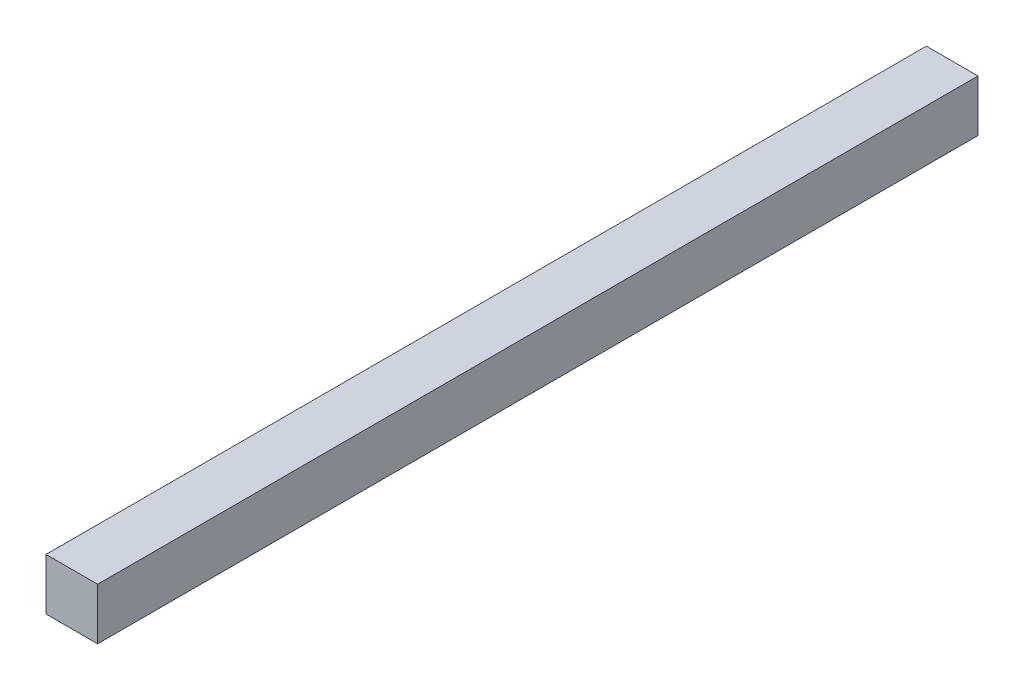
ISO-10303-21;
HEADER;
FILE_DESCRIPTION(('STEP AP214'),'2;1');
FILE_NAME('part.step','',(''),(''),'','','');
FILE_SCHEMA(('AUTOMOTIVE_DESIGN { 1 0 10303 214 1 1 1 1 }'));
ENDSEC;
DATA;
#1=APPLICATION_CONTEXT('core data for automotive mechanical design processes');
#2=APPLICATION_PROTOCOL_DEFINITION('international standard','automotive_design',2000,#1);
#3=PRODUCT_CONTEXT('',#1,'mechanical');
#4=PRODUCT('Part','Part','',(#3));
#5=PRODUCT_RELATED_PRODUCT_CATEGORY('part','',(#4));
#6=PRODUCT_DEFINITION_FORMATION('','',#4);
#7=PRODUCT_DEFINITION_CONTEXT('part definition',#1,'design');
#8=PRODUCT_DEFINITION('design','',#6,#7);
#9=PRODUCT_DEFINITION_SHAPE('','',#8);
#10=(LENGTH_UNIT() NAMED_UNIT(*) SI_UNIT(.MILLI.,.METRE.));
#11=(NAMED_UNIT(*) PLANE_ANGLE_UNIT() SI_UNIT($,.RADIAN.));
#12=(NAMED_UNIT(*) SI_UNIT($,.STERADIAN.) SOLID_ANGLE_UNIT());
#13=UNCERTAINTY_MEASURE_WITH_UNIT(LENGTH_MEASURE(1.E-05),#10,'distance_accuracy_value','');
#14=(GEOMETRIC_REPRESENTATION_CONTEXT(3) GLOBAL_UNCERTAINTY_ASSIGNED_CONTEXT((#13)) GLOBAL_UNIT_ASSIGNED_CONTEXT((#10,
#11,#12)) REPRESENTATION_CONTEXT('',''));
#15=CARTESIAN_POINT('',(0.,0.,0.));
#16=DIRECTION('',(0.,0.,1.));
#17=DIRECTION('',(1.,0.,0.));
#18=AXIS2_PLACEMENT_3D('',#15,#16,#17);
#19=CARTESIAN_POINT('',(0.,0.,60.6425));
#20=DIRECTION('',(1.,0.,0.));
#21=DIRECTION('',(0.,1.,0.));
#22=AXIS2_PLACEMENT_3D('',#19,#20,#21);
#23=PLANE('',#22);
#24=DIRECTION('',(0.,-1.,0.));
#25=VECTOR('',#24,1.);
#26=CARTESIAN_POINT('',(0.,0.,0.));
#27=LINE('',#26,#25);
#28=CARTESIAN_POINT('',(0.,0.,0.));
#29=VERTEX_POINT('',#28);
#30=CARTESIAN_POINT('',(0.,-3.556,0.));
#31=VERTEX_POINT('',#30);
#32=EDGE_CURVE('E111',#29,#31,#27,.T.);
#33=ORIENTED_EDGE('',*,*,#32,.T.);
#34=DIRECTION('',(0.,0.,-1.));
#35=VECTOR('',#34,1.);
#36=CARTESIAN_POINT('',(-1.38777878078145E-13,-3.55599999999992,60.6425000000001));
#37=LINE('',#36,#35);
#38=CARTESIAN_POINT('',(-1.38777878078145E-13,-3.55599999999992,60.6425000000001));
#39=VERTEX_POINT('',#38);
#40=EDGE_CURVE('E11',#39,#31,#37,.T.);
#41=ORIENTED_EDGE('',*,*,#40,.F.);
#42=DIRECTION('',(0.,-1.,0.));
#43=VECTOR('',#42,1.);
#44=CARTESIAN_POINT('',(0.,0.,60.6425));
#45=LINE('',#44,#43);
#46=CARTESIAN_POINT('',(0.,0.,60.6425));
#47=VERTEX_POINT('',#46);
#48=EDGE_CURVE('E94',#47,#39,#45,.T.);
#49=ORIENTED_EDGE('',*,*,#48,.F.);
#50=DIRECTION('',(0.,0.,-1.));
#51=VECTOR('',#50,1.);
#52=CARTESIAN_POINT('',(0.,0.,60.6425));
#53=LINE('',#52,#51);
#54=EDGE_CURVE('E107',#47,#29,#53,.T.);
#55=ORIENTED_EDGE('',*,*,#54,.T.);
#56=EDGE_LOOP('',(#33,#41,#49,#55));
#57=FACE_BOUND('',#56,.T.);
#58=ADVANCED_FACE('F42',(#57),#23,.F.);
#59=CARTESIAN_POINT('',(-1.38777878078145E-13,-3.55599999999992,60.6425000000001));
#60=DIRECTION('',(0.,1.,0.));
#61=DIRECTION('',(0.,0.,1.));
#62=AXIS2_PLACEMENT_3D('',#59,#60,#61);
#63=PLANE('',#62);
#64=DIRECTION('',(1.,0.,0.));
#65=VECTOR('',#64,1.);
#66=CARTESIAN_POINT('',(0.,-3.556,0.));
#67=LINE('',#66,#65);
#68=CARTESIAN_POINT('',(3.55599999999981,-3.55599999999995,0.));
#69=VERTEX_POINT('',#68);
#70=EDGE_CURVE('E99',#31,#69,#67,.T.);
#71=ORIENTED_EDGE('',*,*,#70,.T.);
#72=DIRECTION('',(0.,0.,-1.));
#73=VECTOR('',#72,1.);
#74=CARTESIAN_POINT('',(3.55599999999987,-3.55599999999993,60.6425000000001));
#75=LINE('',#74,#73);
#76=CARTESIAN_POINT('',(3.55599999999987,-3.55599999999993,60.6425000000001));
#77=VERTEX_POINT('',#76);
#78=EDGE_CURVE('E51',#77,#69,#75,.T.);
#79=ORIENTED_EDGE('',*,*,#78,.F.);
#80=DIRECTION('',(1.,0.,0.));
#81=VECTOR('',#80,1.);
#82=CARTESIAN_POINT('',(-1.38777878078145E-13,-3.55599999999992,60.6425000000001));
#83=LINE('',#82,#81);
#84=EDGE_CURVE('E89',#39,#77,#83,.T.);
#85=ORIENTED_EDGE('',*,*,#84,.F.);
#86=ORIENTED_EDGE('',*,*,#40,.T.);
#87=EDGE_LOOP('',(#71,#79,#85,#86));
#88=FACE_BOUND('',#87,.T.);
#89=ADVANCED_FACE('F98',(#88),#63,.F.);
#90=CARTESIAN_POINT('',(3.55599999999987,1.52655665885959E-13,60.6425));
#91=DIRECTION('',(-1.,0.,0.));
#92=DIRECTION('',(0.,-1.,0.));
#93=AXIS2_PLACEMENT_3D('',#90,#91,#92);
#94=PLANE('',#93);
#95=DIRECTION('',(0.,1.,0.));
#96=VECTOR('',#95,1.);
#97=CARTESIAN_POINT('',(3.55599999999981,1.2490009027033E-13,0.));
#98=LINE('',#97,#96);
#99=CARTESIAN_POINT('',(3.55599999999981,1.2490009027033E-13,0.));
#100=VERTEX_POINT('',#99);
#101=EDGE_CURVE('E76',#69,#100,#98,.T.);
#102=ORIENTED_EDGE('',*,*,#101,.T.);
#103=DIRECTION('',(0.,0.,-1.));
#104=VECTOR('',#103,1.);
#105=CARTESIAN_POINT('',(3.55599999999987,1.52655665885959E-13,60.6425));
#106=LINE('',#105,#104);
#107=CARTESIAN_POINT('',(3.55599999999987,1.52655665885959E-13,60.6425));
#108=VERTEX_POINT('',#107);
#109=EDGE_CURVE('E101',#108,#100,#106,.T.);
#110=ORIENTED_EDGE('',*,*,#109,.F.);
#111=DIRECTION('',(0.,1.,0.));
#112=VECTOR('',#111,1.);
#113=CARTESIAN_POINT('',(3.55599999999987,1.52655665885959E-13,60.6425));
#114=LINE('',#113,#112);
#115=EDGE_CURVE('E92',#77,#108,#114,.T.);
#116=ORIENTED_EDGE('',*,*,#115,.F.);
#117=ORIENTED_EDGE('',*,*,#78,.T.);
#118=EDGE_LOOP('',(#102,#110,#116,#117));
#119=FACE_BOUND('',#118,.T.);
#120=ADVANCED_FACE('F102',(#119),#94,.F.);
#121=CARTESIAN_POINT('',(0.,0.,60.6425));
#122=DIRECTION('',(0.,-1.,0.));
#123=DIRECTION('',(0.,0.,-1.));
#124=AXIS2_PLACEMENT_3D('',#121,#122,#123);
#125=PLANE('',#124);
#126=DIRECTION('',(-1.,0.,0.));
#127=VECTOR('',#126,1.);
#128=CARTESIAN_POINT('',(0.,0.,0.));
#129=LINE('',#128,#127);
#130=EDGE_CURVE('E82',#100,#29,#129,.T.);
#131=ORIENTED_EDGE('',*,*,#130,.T.);
#132=ORIENTED_EDGE('',*,*,#54,.F.);
#133=DIRECTION('',(-1.,0.,0.));
#134=VECTOR('',#133,1.);
#135=CARTESIAN_POINT('',(0.,0.,60.6425));
#136=LINE('',#135,#134);
#137=EDGE_CURVE('E59',#108,#47,#136,.T.);
#138=ORIENTED_EDGE('',*,*,#137,.F.);
#139=ORIENTED_EDGE('',*,*,#109,.T.);
#140=EDGE_LOOP('',(#131,#132,#138,#139));
#141=FACE_BOUND('',#140,.T.);
#142=ADVANCED_FACE('F125',(#141),#125,.F.);
#143=CARTESIAN_POINT('',(0.,0.,60.6425));
#144=DIRECTION('',(0.,0.,1.));
#145=DIRECTION('',(1.,0.,0.));
#146=AXIS2_PLACEMENT_3D('',#143,#144,#145);
#147=PLANE('',#146);
#148=ORIENTED_EDGE('',*,*,#48,.T.);
#149=ORIENTED_EDGE('',*,*,#84,.T.);
#150=ORIENTED_EDGE('',*,*,#115,.T.);
#151=ORIENTED_EDGE('',*,*,#137,.T.);
#152=EDGE_LOOP('',(#148,#149,#150,#151));
#153=FACE_BOUND('',#152,.T.);
#154=ADVANCED_FACE('F90',(#153),#147,.T.);
#155=CARTESIAN_POINT('',(0.,0.,0.));
#156=DIRECTION('',(0.,0.,1.));
#157=DIRECTION('',(1.,0.,0.));
#158=AXIS2_PLACEMENT_3D('',#155,#156,#157);
#159=PLANE('',#158);
#160=ORIENTED_EDGE('',*,*,#32,.F.);
#161=ORIENTED_EDGE('',*,*,#130,.F.);
#162=ORIENTED_EDGE('',*,*,#101,.F.);
#163=ORIENTED_EDGE('',*,*,#70,.F.);
#164=EDGE_LOOP('',(#160,#161,#162,#163));
#165=FACE_BOUND('',#164,.T.);
#166=ADVANCED_FACE('F128',(#165),#159,.F.);
#167=CLOSED_SHELL('',(#58,#89,#120,#142,#154,#166));
#168=MANIFOLD_SOLID_BREP('B2',#167);
#169=ADVANCED_BREP_SHAPE_REPRESENTATION('',(#18,#168),#14);
#170=SHAPE_DEFINITION_REPRESENTATION(#9,#169);
ENDSEC;
END-ISO-10303-21;
